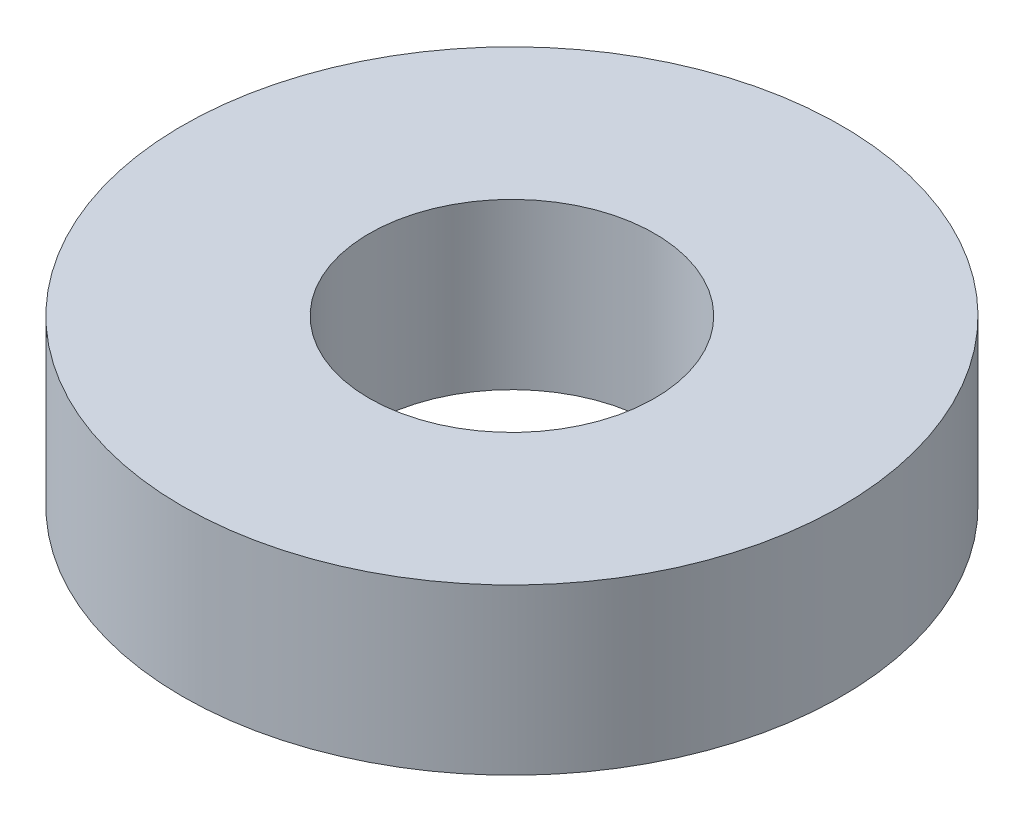
ISO-10303-21;
HEADER;
FILE_DESCRIPTION(('STEP AP214'),'2;1');
FILE_NAME('part.step','',(''),(''),'','','');
FILE_SCHEMA(('AUTOMOTIVE_DESIGN { 1 0 10303 214 1 1 1 1 }'));
ENDSEC;
DATA;
#1=APPLICATION_CONTEXT('core data for automotive mechanical design processes');
#2=APPLICATION_PROTOCOL_DEFINITION('international standard','automotive_design',2000,#1);
#3=PRODUCT_CONTEXT('',#1,'mechanical');
#4=PRODUCT('Part','Part','',(#3));
#5=PRODUCT_RELATED_PRODUCT_CATEGORY('part','',(#4));
#6=PRODUCT_DEFINITION_FORMATION('','',#4);
#7=PRODUCT_DEFINITION_CONTEXT('part definition',#1,'design');
#8=PRODUCT_DEFINITION('design','',#6,#7);
#9=PRODUCT_DEFINITION_SHAPE('','',#8);
#10=(LENGTH_UNIT() NAMED_UNIT(*) SI_UNIT(.MILLI.,.METRE.));
#11=(NAMED_UNIT(*) PLANE_ANGLE_UNIT() SI_UNIT($,.RADIAN.));
#12=(NAMED_UNIT(*) SI_UNIT($,.STERADIAN.) SOLID_ANGLE_UNIT());
#13=UNCERTAINTY_MEASURE_WITH_UNIT(LENGTH_MEASURE(1.E-05),#10,'distance_accuracy_value','');
#14=(GEOMETRIC_REPRESENTATION_CONTEXT(3) GLOBAL_UNCERTAINTY_ASSIGNED_CONTEXT((#13)) GLOBAL_UNIT_ASSIGNED_CONTEXT((#10,
#11,#12)) REPRESENTATION_CONTEXT('',''));
#15=CARTESIAN_POINT('',(0.,0.,0.));
#16=DIRECTION('',(0.,0.,1.));
#17=DIRECTION('',(1.,0.,0.));
#18=AXIS2_PLACEMENT_3D('',#15,#16,#17);
#19=CARTESIAN_POINT('',(0.,12.7,0.));
#20=DIRECTION('',(0.,-1.,0.));
#21=DIRECTION('',(0.,0.,-1.));
#22=AXIS2_PLACEMENT_3D('',#19,#20,#21);
#23=CYLINDRICAL_SURFACE('',#22,25.4);
#24=CARTESIAN_POINT('',(0.,12.7,0.));
#25=DIRECTION('',(0.,1.,0.));
#26=DIRECTION('',(0.,0.,1.));
#27=AXIS2_PLACEMENT_3D('',#24,#25,#26);
#28=CIRCLE('',#27,25.4);
#29=CARTESIAN_POINT('',(0.,12.7,25.4));
#30=VERTEX_POINT('',#29);
#31=EDGE_CURVE('E10',#30,#30,#28,.T.);
#32=ORIENTED_EDGE('',*,*,#31,.F.);
#33=EDGE_LOOP('',(#32));
#34=FACE_BOUND('',#33,.T.);
#35=CARTESIAN_POINT('',(0.,0.,0.));
#36=DIRECTION('',(0.,1.,0.));
#37=DIRECTION('',(0.,0.,1.));
#38=AXIS2_PLACEMENT_3D('',#35,#36,#37);
#39=CIRCLE('',#38,25.4);
#40=CARTESIAN_POINT('',(0.,0.,25.4));
#41=VERTEX_POINT('',#40);
#42=EDGE_CURVE('E40',#41,#41,#39,.T.);
#43=ORIENTED_EDGE('',*,*,#42,.T.);
#44=EDGE_LOOP('',(#43));
#45=FACE_BOUND('',#44,.T.);
#46=ADVANCED_FACE('F33',(#34,#45),#23,.T.);
#47=CARTESIAN_POINT('',(0.,12.7,0.));
#48=DIRECTION('',(0.,1.,0.));
#49=DIRECTION('',(0.,0.,1.));
#50=AXIS2_PLACEMENT_3D('',#47,#48,#49);
#51=PLANE('',#50);
#52=CARTESIAN_POINT('',(0.,12.7,0.));
#53=DIRECTION('',(0.,1.,0.));
#54=DIRECTION('',(0.,0.,1.));
#55=AXIS2_PLACEMENT_3D('',#52,#53,#54);
#56=CIRCLE('',#55,11.);
#57=CARTESIAN_POINT('',(0.,12.7,11.));
#58=VERTEX_POINT('',#57);
#59=EDGE_CURVE('E46',#58,#58,#56,.T.);
#60=ORIENTED_EDGE('',*,*,#59,.F.);
#61=EDGE_LOOP('',(#60));
#62=FACE_BOUND('',#61,.T.);
#63=ORIENTED_EDGE('',*,*,#31,.T.);
#64=EDGE_LOOP('',(#63));
#65=FACE_BOUND('',#64,.T.);
#66=ADVANCED_FACE('F62',(#62,#65),#51,.T.);
#67=CARTESIAN_POINT('',(0.,0.,0.));
#68=DIRECTION('',(0.,1.,0.));
#69=DIRECTION('',(0.,0.,1.));
#70=AXIS2_PLACEMENT_3D('',#67,#68,#69);
#71=PLANE('',#70);
#72=CARTESIAN_POINT('',(0.,0.,0.));
#73=DIRECTION('',(0.,1.,0.));
#74=DIRECTION('',(0.,0.,1.));
#75=AXIS2_PLACEMENT_3D('',#72,#73,#74);
#76=CIRCLE('',#75,11.);
#77=CARTESIAN_POINT('',(0.,0.,11.));
#78=VERTEX_POINT('',#77);
#79=EDGE_CURVE('E36',#78,#78,#76,.T.);
#80=ORIENTED_EDGE('',*,*,#79,.T.);
#81=EDGE_LOOP('',(#80));
#82=FACE_BOUND('',#81,.T.);
#83=ORIENTED_EDGE('',*,*,#42,.F.);
#84=EDGE_LOOP('',(#83));
#85=FACE_BOUND('',#84,.T.);
#86=ADVANCED_FACE('F53',(#82,#85),#71,.F.);
#87=CARTESIAN_POINT('',(0.,-47.3,0.));
#88=DIRECTION('',(0.,1.,0.));
#89=DIRECTION('',(0.,0.,1.));
#90=AXIS2_PLACEMENT_3D('',#87,#88,#89);
#91=CYLINDRICAL_SURFACE('',#90,11.);
#92=ORIENTED_EDGE('',*,*,#59,.T.);
#93=EDGE_LOOP('',(#92));
#94=FACE_BOUND('',#93,.T.);
#95=ORIENTED_EDGE('',*,*,#79,.F.);
#96=EDGE_LOOP('',(#95));
#97=FACE_BOUND('',#96,.T.);
#98=ADVANCED_FACE('F56',(#94,#97),#91,.F.);
#99=CLOSED_SHELL('',(#46,#66,#86,#98));
#100=MANIFOLD_SOLID_BREP('B2',#99);
#101=ADVANCED_BREP_SHAPE_REPRESENTATION('',(#18,#100),#14);
#102=SHAPE_DEFINITION_REPRESENTATION(#9,#101);
ENDSEC;
END-ISO-10303-21;
